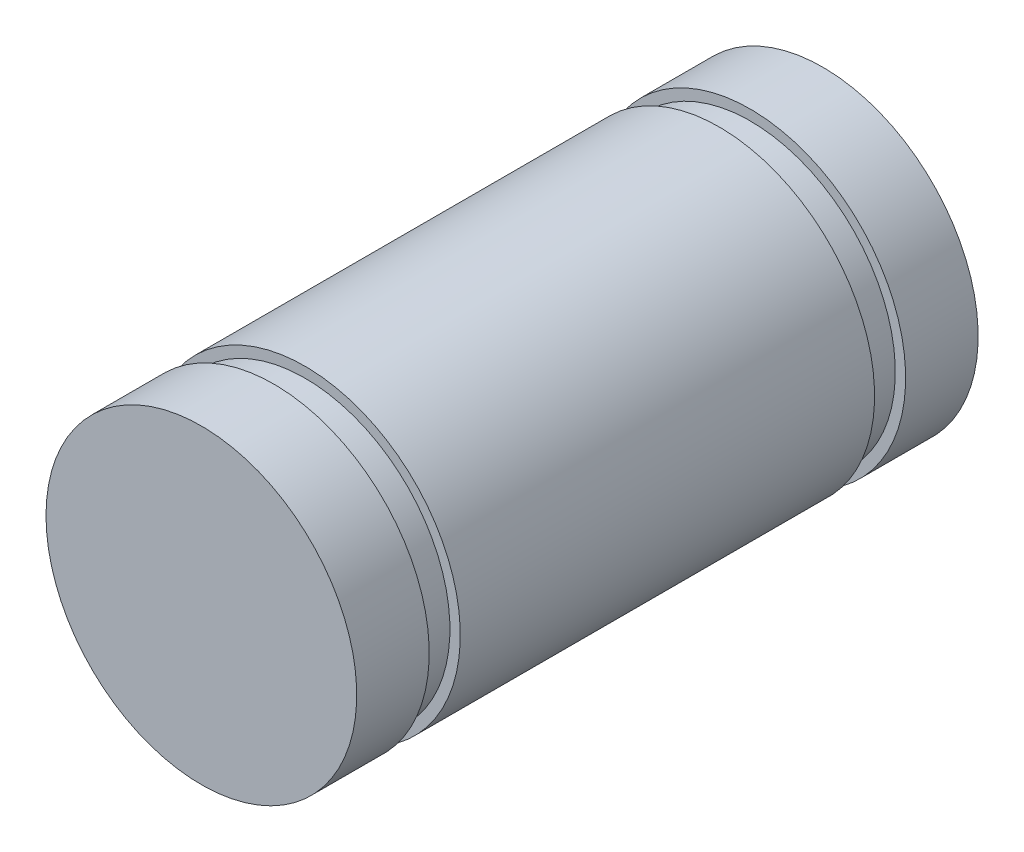
ISO-10303-21;
HEADER;
FILE_DESCRIPTION(('STEP AP214'),'2;1');
FILE_NAME('part.step','',(''),(''),'','','');
FILE_SCHEMA(('AUTOMOTIVE_DESIGN { 1 0 10303 214 1 1 1 1 }'));
ENDSEC;
DATA;
#1=APPLICATION_CONTEXT('core data for automotive mechanical design processes');
#2=APPLICATION_PROTOCOL_DEFINITION('international standard','automotive_design',2000,#1);
#3=PRODUCT_CONTEXT('',#1,'mechanical');
#4=PRODUCT('Part','Part','',(#3));
#5=PRODUCT_RELATED_PRODUCT_CATEGORY('part','',(#4));
#6=PRODUCT_DEFINITION_FORMATION('','',#4);
#7=PRODUCT_DEFINITION_CONTEXT('part definition',#1,'design');
#8=PRODUCT_DEFINITION('design','',#6,#7);
#9=PRODUCT_DEFINITION_SHAPE('','',#8);
#10=(LENGTH_UNIT() NAMED_UNIT(*) SI_UNIT(.MILLI.,.METRE.));
#11=(NAMED_UNIT(*) PLANE_ANGLE_UNIT() SI_UNIT($,.RADIAN.));
#12=(NAMED_UNIT(*) SI_UNIT($,.STERADIAN.) SOLID_ANGLE_UNIT());
#13=UNCERTAINTY_MEASURE_WITH_UNIT(LENGTH_MEASURE(1.E-05),#10,'distance_accuracy_value','');
#14=(GEOMETRIC_REPRESENTATION_CONTEXT(3) GLOBAL_UNCERTAINTY_ASSIGNED_CONTEXT((#13)) GLOBAL_UNIT_ASSIGNED_CONTEXT((#10,
#11,#12)) REPRESENTATION_CONTEXT('',''));
#15=CARTESIAN_POINT('',(0.,0.,0.));
#16=DIRECTION('',(0.,0.,1.));
#17=DIRECTION('',(1.,0.,0.));
#18=AXIS2_PLACEMENT_3D('',#15,#16,#17);
#19=CARTESIAN_POINT('',(0.,0.,12.));
#20=DIRECTION('',(0.,0.,1.));
#21=DIRECTION('',(1.,0.,0.));
#22=AXIS2_PLACEMENT_3D('',#19,#20,#21);
#23=PLANE('',#22);
#24=CARTESIAN_POINT('',(0.,0.,12.));
#25=DIRECTION('',(0.,0.,-1.));
#26=DIRECTION('',(-1.,0.,0.));
#27=AXIS2_PLACEMENT_3D('',#24,#25,#26);
#28=CIRCLE('',#27,3.);
#29=CARTESIAN_POINT('',(-3.,0.,12.));
#30=VERTEX_POINT('',#29);
#31=EDGE_CURVE('E18',#30,#30,#28,.T.);
#32=ORIENTED_EDGE('',*,*,#31,.F.);
#33=EDGE_LOOP('',(#32));
#34=FACE_BOUND('',#33,.T.);
#35=ADVANCED_FACE('F15',(#34),#23,.T.);
#36=CARTESIAN_POINT('',(0.,0.,0.));
#37=DIRECTION('',(0.,0.,1.));
#38=DIRECTION('',(1.,0.,0.));
#39=AXIS2_PLACEMENT_3D('',#36,#37,#38);
#40=PLANE('',#39);
#41=CARTESIAN_POINT('',(0.,0.,0.));
#42=DIRECTION('',(0.,0.,-1.));
#43=DIRECTION('',(-1.,0.,0.));
#44=AXIS2_PLACEMENT_3D('',#41,#42,#43);
#45=CIRCLE('',#44,3.);
#46=CARTESIAN_POINT('',(-3.,0.,0.));
#47=VERTEX_POINT('',#46);
#48=EDGE_CURVE('E46',#47,#47,#45,.F.);
#49=ORIENTED_EDGE('',*,*,#48,.F.);
#50=EDGE_LOOP('',(#49));
#51=FACE_BOUND('',#50,.T.);
#52=ADVANCED_FACE('F56',(#51),#40,.F.);
#53=CARTESIAN_POINT('',(0.,0.,12.));
#54=DIRECTION('',(0.,0.,-1.));
#55=DIRECTION('',(-1.,0.,0.));
#56=AXIS2_PLACEMENT_3D('',#53,#54,#55);
#57=CYLINDRICAL_SURFACE('',#56,3.);
#58=CARTESIAN_POINT('',(0.,0.,10.6));
#59=DIRECTION('',(0.,0.,-1.));
#60=DIRECTION('',(-1.,0.,0.));
#61=AXIS2_PLACEMENT_3D('',#58,#59,#60);
#62=CIRCLE('',#61,3.);
#63=CARTESIAN_POINT('',(-3.,0.,10.6));
#64=VERTEX_POINT('',#63);
#65=EDGE_CURVE('E44',#64,#64,#62,.F.);
#66=ORIENTED_EDGE('',*,*,#65,.T.);
#67=EDGE_LOOP('',(#66));
#68=FACE_BOUND('',#67,.T.);
#69=ORIENTED_EDGE('',*,*,#31,.T.);
#70=EDGE_LOOP('',(#69));
#71=FACE_BOUND('',#70,.T.);
#72=ADVANCED_FACE('F53',(#68,#71),#57,.T.);
#73=CARTESIAN_POINT('',(0.,0.,12.));
#74=DIRECTION('',(0.,0.,-1.));
#75=DIRECTION('',(-1.,0.,0.));
#76=AXIS2_PLACEMENT_3D('',#73,#74,#75);
#77=CYLINDRICAL_SURFACE('',#76,3.);
#78=ORIENTED_EDGE('',*,*,#48,.T.);
#79=EDGE_LOOP('',(#78));
#80=FACE_BOUND('',#79,.T.);
#81=CARTESIAN_POINT('',(0.,0.,1.4));
#82=DIRECTION('',(0.,0.,-1.));
#83=DIRECTION('',(-1.,0.,0.));
#84=AXIS2_PLACEMENT_3D('',#81,#82,#83);
#85=CIRCLE('',#84,3.);
#86=CARTESIAN_POINT('',(-3.,0.,1.4));
#87=VERTEX_POINT('',#86);
#88=EDGE_CURVE('E41',#87,#87,#85,.T.);
#89=ORIENTED_EDGE('',*,*,#88,.T.);
#90=EDGE_LOOP('',(#89));
#91=FACE_BOUND('',#90,.T.);
#92=ADVANCED_FACE('F92',(#80,#91),#77,.T.);
#93=CARTESIAN_POINT('',(-3.,0.,10.6));
#94=DIRECTION('',(0.,0.,1.));
#95=DIRECTION('',(1.,0.,0.));
#96=AXIS2_PLACEMENT_3D('',#93,#94,#95);
#97=PLANE('',#96);
#98=ORIENTED_EDGE('',*,*,#65,.F.);
#99=EDGE_LOOP('',(#98));
#100=FACE_BOUND('',#99,.T.);
#101=CARTESIAN_POINT('',(0.,0.,10.6));
#102=DIRECTION('',(0.,0.,-1.));
#103=DIRECTION('',(-1.,0.,0.));
#104=AXIS2_PLACEMENT_3D('',#101,#102,#103);
#105=CIRCLE('',#104,2.8);
#106=CARTESIAN_POINT('',(-2.8,0.,10.6));
#107=VERTEX_POINT('',#106);
#108=EDGE_CURVE('E38',#107,#107,#105,.T.);
#109=ORIENTED_EDGE('',*,*,#108,.F.);
#110=EDGE_LOOP('',(#109));
#111=FACE_BOUND('',#110,.T.);
#112=ADVANCED_FACE('F88',(#100,#111),#97,.F.);
#113=CARTESIAN_POINT('',(-3.,0.,1.4));
#114=DIRECTION('',(0.,0.,-1.));
#115=DIRECTION('',(-1.,0.,0.));
#116=AXIS2_PLACEMENT_3D('',#113,#114,#115);
#117=PLANE('',#116);
#118=CARTESIAN_POINT('',(0.,0.,1.4));
#119=DIRECTION('',(0.,0.,-1.));
#120=DIRECTION('',(-1.,0.,0.));
#121=AXIS2_PLACEMENT_3D('',#118,#119,#120);
#122=CIRCLE('',#121,2.8);
#123=CARTESIAN_POINT('',(-2.8,0.,1.4));
#124=VERTEX_POINT('',#123);
#125=EDGE_CURVE('E35',#124,#124,#122,.F.);
#126=ORIENTED_EDGE('',*,*,#125,.F.);
#127=EDGE_LOOP('',(#126));
#128=FACE_BOUND('',#127,.T.);
#129=ORIENTED_EDGE('',*,*,#88,.F.);
#130=EDGE_LOOP('',(#129));
#131=FACE_BOUND('',#130,.T.);
#132=ADVANCED_FACE('F84',(#128,#131),#117,.F.);
#133=CARTESIAN_POINT('',(0.,0.,-1.85472649615826));
#134=DIRECTION('',(0.,0.,-1.));
#135=DIRECTION('',(-1.,0.,0.));
#136=AXIS2_PLACEMENT_3D('',#133,#134,#135);
#137=CYLINDRICAL_SURFACE('',#136,2.8);
#138=CARTESIAN_POINT('',(0.,0.,10.));
#139=DIRECTION('',(0.,0.,-1.));
#140=DIRECTION('',(-1.,0.,0.));
#141=AXIS2_PLACEMENT_3D('',#138,#139,#140);
#142=CIRCLE('',#141,2.8);
#143=CARTESIAN_POINT('',(-2.8,0.,10.));
#144=VERTEX_POINT('',#143);
#145=EDGE_CURVE('E32',#144,#144,#142,.F.);
#146=ORIENTED_EDGE('',*,*,#145,.T.);
#147=EDGE_LOOP('',(#146));
#148=FACE_BOUND('',#147,.T.);
#149=ORIENTED_EDGE('',*,*,#108,.T.);
#150=EDGE_LOOP('',(#149));
#151=FACE_BOUND('',#150,.T.);
#152=ADVANCED_FACE('F80',(#148,#151),#137,.T.);
#153=CARTESIAN_POINT('',(0.,0.,-1.85472649615826));
#154=DIRECTION('',(0.,0.,-1.));
#155=DIRECTION('',(-1.,0.,0.));
#156=AXIS2_PLACEMENT_3D('',#153,#154,#155);
#157=CYLINDRICAL_SURFACE('',#156,2.8);
#158=ORIENTED_EDGE('',*,*,#125,.T.);
#159=EDGE_LOOP('',(#158));
#160=FACE_BOUND('',#159,.T.);
#161=CARTESIAN_POINT('',(0.,0.,2.));
#162=DIRECTION('',(0.,0.,-1.));
#163=DIRECTION('',(-1.,0.,0.));
#164=AXIS2_PLACEMENT_3D('',#161,#162,#163);
#165=CIRCLE('',#164,2.8);
#166=CARTESIAN_POINT('',(-2.8,0.,2.));
#167=VERTEX_POINT('',#166);
#168=EDGE_CURVE('E27',#167,#167,#165,.T.);
#169=ORIENTED_EDGE('',*,*,#168,.T.);
#170=EDGE_LOOP('',(#169));
#171=FACE_BOUND('',#170,.T.);
#172=ADVANCED_FACE('F76',(#160,#171),#157,.T.);
#173=CARTESIAN_POINT('',(-3.,0.,10.));
#174=DIRECTION('',(0.,0.,-1.));
#175=DIRECTION('',(-1.,0.,0.));
#176=AXIS2_PLACEMENT_3D('',#173,#174,#175);
#177=PLANE('',#176);
#178=ORIENTED_EDGE('',*,*,#145,.F.);
#179=EDGE_LOOP('',(#178));
#180=FACE_BOUND('',#179,.T.);
#181=CARTESIAN_POINT('',(0.,0.,10.));
#182=DIRECTION('',(0.,0.,-1.));
#183=DIRECTION('',(-1.,0.,0.));
#184=AXIS2_PLACEMENT_3D('',#181,#182,#183);
#185=CIRCLE('',#184,3.);
#186=CARTESIAN_POINT('',(-3.,0.,10.));
#187=VERTEX_POINT('',#186);
#188=EDGE_CURVE('E22',#187,#187,#185,.T.);
#189=ORIENTED_EDGE('',*,*,#188,.F.);
#190=EDGE_LOOP('',(#189));
#191=FACE_BOUND('',#190,.T.);
#192=ADVANCED_FACE('F69',(#180,#191),#177,.F.);
#193=CARTESIAN_POINT('',(-3.,0.,2.));
#194=DIRECTION('',(0.,0.,1.));
#195=DIRECTION('',(1.,0.,0.));
#196=AXIS2_PLACEMENT_3D('',#193,#194,#195);
#197=PLANE('',#196);
#198=CARTESIAN_POINT('',(0.,0.,2.));
#199=DIRECTION('',(0.,0.,-1.));
#200=DIRECTION('',(-1.,0.,0.));
#201=AXIS2_PLACEMENT_3D('',#198,#199,#200);
#202=CIRCLE('',#201,3.);
#203=CARTESIAN_POINT('',(-3.,0.,2.));
#204=VERTEX_POINT('',#203);
#205=EDGE_CURVE('E10',#204,#204,#202,.F.);
#206=ORIENTED_EDGE('',*,*,#205,.F.);
#207=EDGE_LOOP('',(#206));
#208=FACE_BOUND('',#207,.T.);
#209=ORIENTED_EDGE('',*,*,#168,.F.);
#210=EDGE_LOOP('',(#209));
#211=FACE_BOUND('',#210,.T.);
#212=ADVANCED_FACE('F64',(#208,#211),#197,.F.);
#213=CARTESIAN_POINT('',(0.,0.,12.));
#214=DIRECTION('',(0.,0.,-1.));
#215=DIRECTION('',(-1.,0.,0.));
#216=AXIS2_PLACEMENT_3D('',#213,#214,#215);
#217=CYLINDRICAL_SURFACE('',#216,3.);
#218=ORIENTED_EDGE('',*,*,#205,.T.);
#219=EDGE_LOOP('',(#218));
#220=FACE_BOUND('',#219,.T.);
#221=ORIENTED_EDGE('',*,*,#188,.T.);
#222=EDGE_LOOP('',(#221));
#223=FACE_BOUND('',#222,.T.);
#224=ADVANCED_FACE('F62',(#220,#223),#217,.T.);
#225=CLOSED_SHELL('',(#35,#52,#72,#92,#112,#132,#152,#172,#192,#212,#224));
#226=MANIFOLD_SOLID_BREP('B1',#225);
#227=ADVANCED_BREP_SHAPE_REPRESENTATION('',(#18,#226),#14);
#228=SHAPE_DEFINITION_REPRESENTATION(#9,#227);
ENDSEC;
END-ISO-10303-21;
